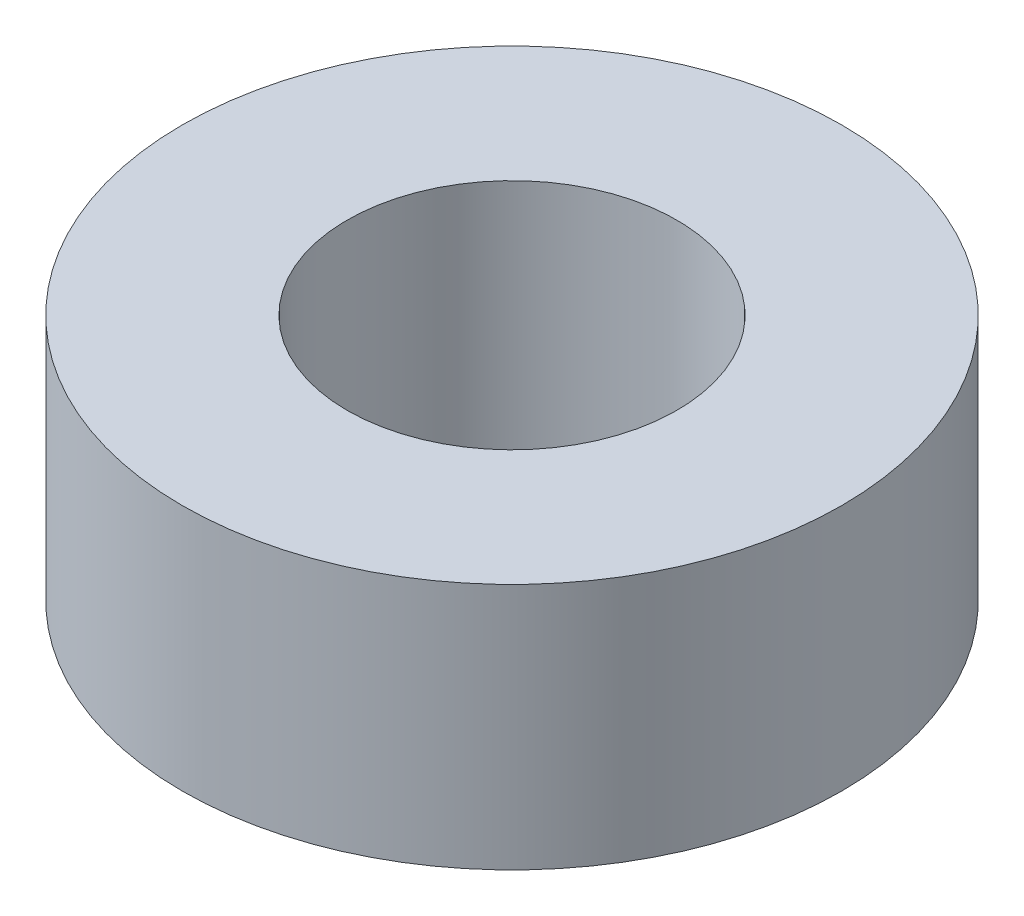
ISO-10303-21;
HEADER;
FILE_DESCRIPTION(('STEP AP214'),'2;1');
FILE_NAME('part.step','',(''),(''),'','','');
FILE_SCHEMA(('AUTOMOTIVE_DESIGN { 1 0 10303 214 1 1 1 1 }'));
ENDSEC;
DATA;
#1=APPLICATION_CONTEXT('core data for automotive mechanical design processes');
#2=APPLICATION_PROTOCOL_DEFINITION('international standard','automotive_design',2000,#1);
#3=PRODUCT_CONTEXT('',#1,'mechanical');
#4=PRODUCT('Part','Part','',(#3));
#5=PRODUCT_RELATED_PRODUCT_CATEGORY('part','',(#4));
#6=PRODUCT_DEFINITION_FORMATION('','',#4);
#7=PRODUCT_DEFINITION_CONTEXT('part definition',#1,'design');
#8=PRODUCT_DEFINITION('design','',#6,#7);
#9=PRODUCT_DEFINITION_SHAPE('','',#8);
#10=(LENGTH_UNIT() NAMED_UNIT(*) SI_UNIT(.MILLI.,.METRE.));
#11=(NAMED_UNIT(*) PLANE_ANGLE_UNIT() SI_UNIT($,.RADIAN.));
#12=(NAMED_UNIT(*) SI_UNIT($,.STERADIAN.) SOLID_ANGLE_UNIT());
#13=UNCERTAINTY_MEASURE_WITH_UNIT(LENGTH_MEASURE(1.E-05),#10,'distance_accuracy_value','');
#14=(GEOMETRIC_REPRESENTATION_CONTEXT(3) GLOBAL_UNCERTAINTY_ASSIGNED_CONTEXT((#13)) GLOBAL_UNIT_ASSIGNED_CONTEXT((#10,
#11,#12)) REPRESENTATION_CONTEXT('',''));
#15=CARTESIAN_POINT('',(0.,0.,0.));
#16=DIRECTION('',(0.,0.,1.));
#17=DIRECTION('',(1.,0.,0.));
#18=AXIS2_PLACEMENT_3D('',#15,#16,#17);
#19=CARTESIAN_POINT('',(0.,3.,0.));
#20=DIRECTION('',(0.,1.,0.));
#21=DIRECTION('',(0.,0.,1.));
#22=AXIS2_PLACEMENT_3D('',#19,#20,#21);
#23=PLANE('',#22);
#24=CARTESIAN_POINT('',(0.,3.,0.));
#25=DIRECTION('',(0.,1.,0.));
#26=DIRECTION('',(0.,0.,1.));
#27=AXIS2_PLACEMENT_3D('',#24,#25,#26);
#28=CIRCLE('',#27,4.);
#29=CARTESIAN_POINT('',(0.,3.,4.));
#30=VERTEX_POINT('',#29);
#31=EDGE_CURVE('E10',#30,#30,#28,.T.);
#32=ORIENTED_EDGE('',*,*,#31,.T.);
#33=EDGE_LOOP('',(#32));
#34=FACE_BOUND('',#33,.T.);
#35=CARTESIAN_POINT('',(0.,3.,0.));
#36=DIRECTION('',(0.,1.,0.));
#37=DIRECTION('',(0.,0.,1.));
#38=AXIS2_PLACEMENT_3D('',#35,#36,#37);
#39=CIRCLE('',#38,2.);
#40=CARTESIAN_POINT('',(0.,3.,2.));
#41=VERTEX_POINT('',#40);
#42=EDGE_CURVE('E50',#41,#41,#39,.T.);
#43=ORIENTED_EDGE('',*,*,#42,.F.);
#44=EDGE_LOOP('',(#43));
#45=FACE_BOUND('',#44,.T.);
#46=ADVANCED_FACE('F37',(#34,#45),#23,.T.);
#47=CARTESIAN_POINT('',(0.,0.,0.));
#48=DIRECTION('',(0.,1.,0.));
#49=DIRECTION('',(0.,0.,1.));
#50=AXIS2_PLACEMENT_3D('',#47,#48,#49);
#51=PLANE('',#50);
#52=CARTESIAN_POINT('',(0.,0.,0.));
#53=DIRECTION('',(0.,1.,0.));
#54=DIRECTION('',(0.,0.,1.));
#55=AXIS2_PLACEMENT_3D('',#52,#53,#54);
#56=CIRCLE('',#55,4.);
#57=CARTESIAN_POINT('',(0.,0.,4.));
#58=VERTEX_POINT('',#57);
#59=EDGE_CURVE('E41',#58,#58,#56,.T.);
#60=ORIENTED_EDGE('',*,*,#59,.F.);
#61=EDGE_LOOP('',(#60));
#62=FACE_BOUND('',#61,.T.);
#63=CARTESIAN_POINT('',(0.,0.,0.));
#64=DIRECTION('',(0.,1.,0.));
#65=DIRECTION('',(0.,0.,1.));
#66=AXIS2_PLACEMENT_3D('',#63,#64,#65);
#67=CIRCLE('',#66,2.);
#68=CARTESIAN_POINT('',(0.,0.,2.));
#69=VERTEX_POINT('',#68);
#70=EDGE_CURVE('E52',#69,#69,#67,.T.);
#71=ORIENTED_EDGE('',*,*,#70,.T.);
#72=EDGE_LOOP('',(#71));
#73=FACE_BOUND('',#72,.T.);
#74=ADVANCED_FACE('F64',(#62,#73),#51,.F.);
#75=CARTESIAN_POINT('',(0.,3.,0.));
#76=DIRECTION('',(0.,-1.,0.));
#77=DIRECTION('',(0.,0.,-1.));
#78=AXIS2_PLACEMENT_3D('',#75,#76,#77);
#79=CYLINDRICAL_SURFACE('',#78,4.);
#80=ORIENTED_EDGE('',*,*,#31,.F.);
#81=EDGE_LOOP('',(#80));
#82=FACE_BOUND('',#81,.T.);
#83=ORIENTED_EDGE('',*,*,#59,.T.);
#84=EDGE_LOOP('',(#83));
#85=FACE_BOUND('',#84,.T.);
#86=ADVANCED_FACE('F39',(#82,#85),#79,.T.);
#87=CARTESIAN_POINT('',(0.,3.,0.));
#88=DIRECTION('',(0.,-1.,0.));
#89=DIRECTION('',(0.,0.,-1.));
#90=AXIS2_PLACEMENT_3D('',#87,#88,#89);
#91=CYLINDRICAL_SURFACE('',#90,2.);
#92=ORIENTED_EDGE('',*,*,#42,.T.);
#93=EDGE_LOOP('',(#92));
#94=FACE_BOUND('',#93,.T.);
#95=ORIENTED_EDGE('',*,*,#70,.F.);
#96=EDGE_LOOP('',(#95));
#97=FACE_BOUND('',#96,.T.);
#98=ADVANCED_FACE('F60',(#94,#97),#91,.F.);
#99=CLOSED_SHELL('',(#46,#74,#86,#98));
#100=MANIFOLD_SOLID_BREP('B2',#99);
#101=ADVANCED_BREP_SHAPE_REPRESENTATION('',(#18,#100),#14);
#102=SHAPE_DEFINITION_REPRESENTATION(#9,#101);
ENDSEC;
END-ISO-10303-21;
